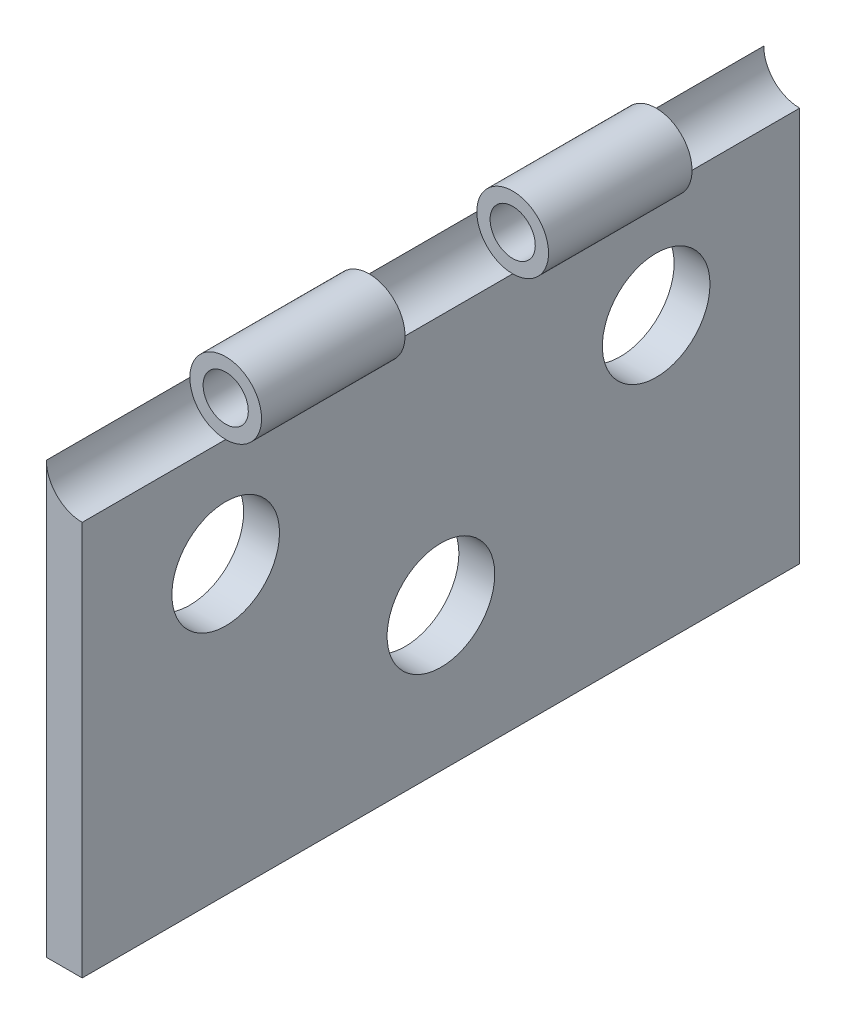
ISO-10303-21;
HEADER;
FILE_DESCRIPTION(('STEP AP214'),'2;1');
FILE_NAME('part.step','',(''),(''),'','','');
FILE_SCHEMA(('AUTOMOTIVE_DESIGN { 1 0 10303 214 1 1 1 1 }'));
ENDSEC;
DATA;
#1=APPLICATION_CONTEXT('core data for automotive mechanical design processes');
#2=APPLICATION_PROTOCOL_DEFINITION('international standard','automotive_design',2000,#1);
#3=PRODUCT_CONTEXT('',#1,'mechanical');
#4=PRODUCT('Part','Part','',(#3));
#5=PRODUCT_RELATED_PRODUCT_CATEGORY('part','',(#4));
#6=PRODUCT_DEFINITION_FORMATION('','',#4);
#7=PRODUCT_DEFINITION_CONTEXT('part definition',#1,'design');
#8=PRODUCT_DEFINITION('design','',#6,#7);
#9=PRODUCT_DEFINITION_SHAPE('','',#8);
#10=(LENGTH_UNIT() NAMED_UNIT(*) SI_UNIT(.MILLI.,.METRE.));
#11=(NAMED_UNIT(*) PLANE_ANGLE_UNIT() SI_UNIT($,.RADIAN.));
#12=(NAMED_UNIT(*) SI_UNIT($,.STERADIAN.) SOLID_ANGLE_UNIT());
#13=UNCERTAINTY_MEASURE_WITH_UNIT(LENGTH_MEASURE(1.E-05),#10,'distance_accuracy_value','');
#14=(GEOMETRIC_REPRESENTATION_CONTEXT(3) GLOBAL_UNCERTAINTY_ASSIGNED_CONTEXT((#13)) GLOBAL_UNIT_ASSIGNED_CONTEXT((#10,
#11,#12)) REPRESENTATION_CONTEXT('',''));
#15=CARTESIAN_POINT('',(0.,0.,0.));
#16=DIRECTION('',(0.,0.,1.));
#17=DIRECTION('',(1.,0.,0.));
#18=AXIS2_PLACEMENT_3D('',#15,#16,#17);
#19=CARTESIAN_POINT('',(1.24999999999997,15.,0.));
#20=DIRECTION('',(0.,0.,-1.));
#21=DIRECTION('',(0.,0.999999999999983,0.));
#22=AXIS2_PLACEMENT_3D('',#19,#20,#21);
#23=CYLINDRICAL_SURFACE('',#22,0.7875);
#24=CARTESIAN_POINT('',(1.24999999999997,15.,-5.));
#25=DIRECTION('',(0.,0.,-1.));
#26=DIRECTION('',(0.,0.999999999999983,0.));
#27=AXIS2_PLACEMENT_3D('',#24,#25,#26);
#28=CIRCLE('',#27,0.7875);
#29=CARTESIAN_POINT('',(1.24999999999997,15.7875,-5.));
#30=VERTEX_POINT('',#29);
#31=EDGE_CURVE('E11',#30,#30,#28,.T.);
#32=ORIENTED_EDGE('',*,*,#31,.F.);
#33=EDGE_LOOP('',(#32));
#34=FACE_BOUND('',#33,.T.);
#35=CARTESIAN_POINT('',(1.24999999999997,15.,-9.99999999999998));
#36=DIRECTION('',(0.,0.,-1.));
#37=DIRECTION('',(0.,0.999999999999983,0.));
#38=AXIS2_PLACEMENT_3D('',#35,#36,#37);
#39=CIRCLE('',#38,0.7875);
#40=CARTESIAN_POINT('',(1.24999999999997,15.7875,-9.99999999999998));
#41=VERTEX_POINT('',#40);
#42=EDGE_CURVE('E163',#41,#41,#39,.T.);
#43=ORIENTED_EDGE('',*,*,#42,.T.);
#44=EDGE_LOOP('',(#43));
#45=FACE_BOUND('',#44,.T.);
#46=ADVANCED_FACE('F32',(#34,#45),#23,.F.);
#47=CARTESIAN_POINT('',(1.24999999999997,15.,-15.));
#48=DIRECTION('',(0.,0.,-1.));
#49=DIRECTION('',(0.,0.999999999999983,0.));
#50=AXIS2_PLACEMENT_3D('',#47,#48,#49);
#51=CIRCLE('',#50,0.7875);
#52=CARTESIAN_POINT('',(1.24999999999997,15.7875,-15.));
#53=VERTEX_POINT('',#52);
#54=EDGE_CURVE('E160',#53,#53,#51,.T.);
#55=ORIENTED_EDGE('',*,*,#54,.F.);
#56=EDGE_LOOP('',(#55));
#57=FACE_BOUND('',#56,.T.);
#58=CARTESIAN_POINT('',(1.24999999999997,15.,-20.));
#59=DIRECTION('',(0.,0.,-1.));
#60=DIRECTION('',(0.,0.999999999999983,0.));
#61=AXIS2_PLACEMENT_3D('',#58,#59,#60);
#62=CIRCLE('',#61,0.7875);
#63=CARTESIAN_POINT('',(1.24999999999997,15.7875,-20.));
#64=VERTEX_POINT('',#63);
#65=EDGE_CURVE('E155',#64,#64,#62,.T.);
#66=ORIENTED_EDGE('',*,*,#65,.T.);
#67=EDGE_LOOP('',(#66));
#68=FACE_BOUND('',#67,.T.);
#69=ADVANCED_FACE('F244',(#57,#68),#23,.F.);
#70=CARTESIAN_POINT('',(1.24999999999997,0.,0.));
#71=DIRECTION('',(-1.,0.,0.));
#72=DIRECTION('',(0.,0.,1.));
#73=AXIS2_PLACEMENT_3D('',#70,#71,#72);
#74=PLANE('',#73);
#75=CARTESIAN_POINT('',(1.24999999999997,5.,-12.5));
#76=DIRECTION('',(1.,0.,0.));
#77=DIRECTION('',(0.,0.,-1.));
#78=AXIS2_PLACEMENT_3D('',#75,#76,#77);
#79=CIRCLE('',#78,1.875);
#80=CARTESIAN_POINT('',(1.24999999999997,5.,-14.375));
#81=VERTEX_POINT('',#80);
#82=EDGE_CURVE('E126',#81,#81,#79,.T.);
#83=ORIENTED_EDGE('',*,*,#82,.F.);
#84=EDGE_LOOP('',(#83));
#85=FACE_BOUND('',#84,.T.);
#86=DIRECTION('',(0.,0.,1.));
#87=VECTOR('',#86,1.);
#88=CARTESIAN_POINT('',(1.24999999999997,13.75,-9.99999999999998));
#89=LINE('',#88,#87);
#90=CARTESIAN_POINT('',(1.24999999999997,13.75,-5.));
#91=VERTEX_POINT('',#90);
#92=CARTESIAN_POINT('',(1.24999999999997,13.75,-9.99999999999998));
#93=VERTEX_POINT('',#92);
#94=EDGE_CURVE('E146',#91,#93,#89,.F.);
#95=ORIENTED_EDGE('',*,*,#94,.F.);
#96=DIRECTION('',(0.,0.,-1.));
#97=VECTOR('',#96,1.);
#98=CARTESIAN_POINT('',(1.24999999999997,13.75,0.));
#99=LINE('',#98,#97);
#100=CARTESIAN_POINT('',(1.24999999999997,13.75,0.));
#101=VERTEX_POINT('',#100);
#102=EDGE_CURVE('E97',#91,#101,#99,.F.);
#103=ORIENTED_EDGE('',*,*,#102,.T.);
#104=DIRECTION('',(0.,-0.999999999999983,0.));
#105=VECTOR('',#104,1.);
#106=CARTESIAN_POINT('',(1.24999999999997,0.,0.));
#107=LINE('',#106,#105);
#108=CARTESIAN_POINT('',(1.24999999999997,0.,0.));
#109=VERTEX_POINT('',#108);
#110=EDGE_CURVE('E96',#101,#109,#107,.T.);
#111=ORIENTED_EDGE('',*,*,#110,.T.);
#112=DIRECTION('',(0.,0.,-1.));
#113=VECTOR('',#112,1.);
#114=CARTESIAN_POINT('',(1.24999999999997,0.,0.));
#115=LINE('',#114,#113);
#116=CARTESIAN_POINT('',(1.24999999999997,0.,-25.));
#117=VERTEX_POINT('',#116);
#118=EDGE_CURVE('E56',#109,#117,#115,.T.);
#119=ORIENTED_EDGE('',*,*,#118,.T.);
#120=DIRECTION('',(0.,0.999999999999983,0.));
#121=VECTOR('',#120,1.);
#122=CARTESIAN_POINT('',(1.24999999999997,0.,-25.));
#123=LINE('',#122,#121);
#124=CARTESIAN_POINT('',(1.24999999999997,13.75,-25.));
#125=VERTEX_POINT('',#124);
#126=EDGE_CURVE('E111',#117,#125,#123,.T.);
#127=ORIENTED_EDGE('',*,*,#126,.T.);
#128=DIRECTION('',(0.,0.,-1.));
#129=VECTOR('',#128,1.);
#130=CARTESIAN_POINT('',(1.24999999999997,13.75,-20.));
#131=LINE('',#130,#129);
#132=CARTESIAN_POINT('',(1.24999999999997,13.75,-20.));
#133=VERTEX_POINT('',#132);
#134=EDGE_CURVE('E166',#125,#133,#131,.F.);
#135=ORIENTED_EDGE('',*,*,#134,.T.);
#136=DIRECTION('',(0.,0.,1.));
#137=VECTOR('',#136,1.);
#138=CARTESIAN_POINT('',(1.24999999999997,13.75,-20.));
#139=LINE('',#138,#137);
#140=CARTESIAN_POINT('',(1.24999999999997,13.75,-15.));
#141=VERTEX_POINT('',#140);
#142=EDGE_CURVE('E137',#141,#133,#139,.F.);
#143=ORIENTED_EDGE('',*,*,#142,.F.);
#144=DIRECTION('',(0.,0.,-1.));
#145=VECTOR('',#144,1.);
#146=CARTESIAN_POINT('',(1.24999999999997,13.75,-9.99999999999998));
#147=LINE('',#146,#145);
#148=EDGE_CURVE('E173',#141,#93,#147,.F.);
#149=ORIENTED_EDGE('',*,*,#148,.T.);
#150=EDGE_LOOP('',(#95,#103,#111,#119,#127,#135,#143,#149));
#151=FACE_BOUND('',#150,.T.);
#152=CARTESIAN_POINT('',(1.24999999999997,10.,-20.));
#153=DIRECTION('',(1.,0.,0.));
#154=DIRECTION('',(0.,0.,-1.));
#155=AXIS2_PLACEMENT_3D('',#152,#153,#154);
#156=CIRCLE('',#155,1.875);
#157=CARTESIAN_POINT('',(1.24999999999997,10.,-21.875));
#158=VERTEX_POINT('',#157);
#159=EDGE_CURVE('E104',#158,#158,#156,.T.);
#160=ORIENTED_EDGE('',*,*,#159,.F.);
#161=EDGE_LOOP('',(#160));
#162=FACE_BOUND('',#161,.T.);
#163=CARTESIAN_POINT('',(1.24999999999997,9.99999999999999,-5.));
#164=DIRECTION('',(1.,0.,0.));
#165=DIRECTION('',(0.,0.,-1.));
#166=AXIS2_PLACEMENT_3D('',#163,#164,#165);
#167=CIRCLE('',#166,1.875);
#168=CARTESIAN_POINT('',(1.24999999999997,9.99999999999999,-6.875));
#169=VERTEX_POINT('',#168);
#170=EDGE_CURVE('E131',#169,#169,#167,.T.);
#171=ORIENTED_EDGE('',*,*,#170,.F.);
#172=EDGE_LOOP('',(#171));
#173=FACE_BOUND('',#172,.T.);
#174=ADVANCED_FACE('F184',(#85,#151,#162,#173),#74,.F.);
#175=CARTESIAN_POINT('',(0.,0.,0.));
#176=DIRECTION('',(-1.,0.,0.));
#177=DIRECTION('',(0.,0.,1.));
#178=AXIS2_PLACEMENT_3D('',#175,#176,#177);
#179=PLANE('',#178);
#180=CARTESIAN_POINT('',(0.,5.,-12.5));
#181=DIRECTION('',(1.,0.,0.));
#182=DIRECTION('',(0.,0.,-1.));
#183=AXIS2_PLACEMENT_3D('',#180,#181,#182);
#184=CIRCLE('',#183,1.875);
#185=CARTESIAN_POINT('',(0.,5.,-14.375));
#186=VERTEX_POINT('',#185);
#187=EDGE_CURVE('E128',#186,#186,#184,.T.);
#188=ORIENTED_EDGE('',*,*,#187,.T.);
#189=EDGE_LOOP('',(#188));
#190=FACE_BOUND('',#189,.T.);
#191=DIRECTION('',(0.,-0.999999999999983,0.));
#192=VECTOR('',#191,1.);
#193=CARTESIAN_POINT('',(0.,0.,0.));
#194=LINE('',#193,#192);
#195=CARTESIAN_POINT('',(0.,15.,0.));
#196=VERTEX_POINT('',#195);
#197=CARTESIAN_POINT('',(0.,0.,0.));
#198=VERTEX_POINT('',#197);
#199=EDGE_CURVE('E95',#196,#198,#194,.T.);
#200=ORIENTED_EDGE('',*,*,#199,.F.);
#201=DIRECTION('',(0.,0.,1.));
#202=VECTOR('',#201,1.);
#203=CARTESIAN_POINT('',(0.,15.,0.));
#204=LINE('',#203,#202);
#205=CARTESIAN_POINT('',(0.,15.,-5.));
#206=VERTEX_POINT('',#205);
#207=EDGE_CURVE('E73',#206,#196,#204,.T.);
#208=ORIENTED_EDGE('',*,*,#207,.F.);
#209=CARTESIAN_POINT('',(0.,15.,-9.99999999999998));
#210=VERTEX_POINT('',#209);
#211=EDGE_CURVE('E87',#210,#206,#204,.T.);
#212=ORIENTED_EDGE('',*,*,#211,.F.);
#213=CARTESIAN_POINT('',(0.,15.,-15.));
#214=VERTEX_POINT('',#213);
#215=EDGE_CURVE('E198',#214,#210,#204,.T.);
#216=ORIENTED_EDGE('',*,*,#215,.F.);
#217=CARTESIAN_POINT('',(0.,15.,-20.));
#218=VERTEX_POINT('',#217);
#219=EDGE_CURVE('E117',#218,#214,#204,.T.);
#220=ORIENTED_EDGE('',*,*,#219,.F.);
#221=CARTESIAN_POINT('',(0.,15.,-25.));
#222=VERTEX_POINT('',#221);
#223=EDGE_CURVE('E90',#222,#218,#204,.T.);
#224=ORIENTED_EDGE('',*,*,#223,.F.);
#225=DIRECTION('',(0.,0.999999999999983,0.));
#226=VECTOR('',#225,1.);
#227=CARTESIAN_POINT('',(0.,0.,-25.));
#228=LINE('',#227,#226);
#229=CARTESIAN_POINT('',(0.,0.,-25.));
#230=VERTEX_POINT('',#229);
#231=EDGE_CURVE('E88',#230,#222,#228,.T.);
#232=ORIENTED_EDGE('',*,*,#231,.F.);
#233=DIRECTION('',(0.,0.,-1.));
#234=VECTOR('',#233,1.);
#235=CARTESIAN_POINT('',(0.,0.,0.));
#236=LINE('',#235,#234);
#237=EDGE_CURVE('E102',#198,#230,#236,.T.);
#238=ORIENTED_EDGE('',*,*,#237,.F.);
#239=EDGE_LOOP('',(#200,#208,#212,#216,#220,#224,#232,#238));
#240=FACE_BOUND('',#239,.T.);
#241=CARTESIAN_POINT('',(0.,10.,-20.));
#242=DIRECTION('',(1.,0.,0.));
#243=DIRECTION('',(0.,0.,-1.));
#244=AXIS2_PLACEMENT_3D('',#241,#242,#243);
#245=CIRCLE('',#244,1.875);
#246=CARTESIAN_POINT('',(0.,10.,-21.875));
#247=VERTEX_POINT('',#246);
#248=EDGE_CURVE('E108',#247,#247,#245,.T.);
#249=ORIENTED_EDGE('',*,*,#248,.T.);
#250=EDGE_LOOP('',(#249));
#251=FACE_BOUND('',#250,.T.);
#252=CARTESIAN_POINT('',(0.,9.99999999999999,-5.));
#253=DIRECTION('',(1.,0.,0.));
#254=DIRECTION('',(0.,0.,-1.));
#255=AXIS2_PLACEMENT_3D('',#252,#253,#254);
#256=CIRCLE('',#255,1.875);
#257=CARTESIAN_POINT('',(0.,9.99999999999999,-6.875));
#258=VERTEX_POINT('',#257);
#259=EDGE_CURVE('E134',#258,#258,#256,.T.);
#260=ORIENTED_EDGE('',*,*,#259,.T.);
#261=EDGE_LOOP('',(#260));
#262=FACE_BOUND('',#261,.T.);
#263=ADVANCED_FACE('F99',(#190,#240,#251,#262),#179,.T.);
#264=CARTESIAN_POINT('',(1.24999999999997,0.,0.));
#265=DIRECTION('',(0.,0.,-1.));
#266=DIRECTION('',(0.,0.999999999999983,0.));
#267=AXIS2_PLACEMENT_3D('',#264,#265,#266);
#268=PLANE('',#267);
#269=ORIENTED_EDGE('',*,*,#110,.F.);
#270=CARTESIAN_POINT('',(1.24999999999997,15.,0.));
#271=DIRECTION('',(0.,0.,-1.));
#272=DIRECTION('',(0.,0.999999999999983,0.));
#273=AXIS2_PLACEMENT_3D('',#270,#271,#272);
#274=CIRCLE('',#273,1.25);
#275=EDGE_CURVE('E78',#101,#196,#274,.T.);
#276=ORIENTED_EDGE('',*,*,#275,.T.);
#277=ORIENTED_EDGE('',*,*,#199,.T.);
#278=DIRECTION('',(-1.,0.,0.));
#279=VECTOR('',#278,1.);
#280=CARTESIAN_POINT('',(1.24999999999997,0.,0.));
#281=LINE('',#280,#279);
#282=EDGE_CURVE('E40',#109,#198,#281,.T.);
#283=ORIENTED_EDGE('',*,*,#282,.F.);
#284=EDGE_LOOP('',(#269,#276,#277,#283));
#285=FACE_BOUND('',#284,.T.);
#286=ADVANCED_FACE('F34',(#285),#268,.F.);
#287=CARTESIAN_POINT('',(1.24999999999997,0.,0.));
#288=DIRECTION('',(0.,0.999999999999983,0.));
#289=DIRECTION('',(0.,0.,1.));
#290=AXIS2_PLACEMENT_3D('',#287,#288,#289);
#291=PLANE('',#290);
#292=ORIENTED_EDGE('',*,*,#237,.T.);
#293=DIRECTION('',(-1.,0.,0.));
#294=VECTOR('',#293,1.);
#295=CARTESIAN_POINT('',(1.24999999999997,0.,-25.));
#296=LINE('',#295,#294);
#297=EDGE_CURVE('E118',#117,#230,#296,.T.);
#298=ORIENTED_EDGE('',*,*,#297,.F.);
#299=ORIENTED_EDGE('',*,*,#118,.F.);
#300=ORIENTED_EDGE('',*,*,#282,.T.);
#301=EDGE_LOOP('',(#292,#298,#299,#300));
#302=FACE_BOUND('',#301,.T.);
#303=ADVANCED_FACE('F121',(#302),#291,.F.);
#304=CARTESIAN_POINT('',(1.24999999999997,0.,-25.));
#305=DIRECTION('',(0.,0.,1.));
#306=DIRECTION('',(0.,-0.999999999999983,0.));
#307=AXIS2_PLACEMENT_3D('',#304,#305,#306);
#308=PLANE('',#307);
#309=ORIENTED_EDGE('',*,*,#231,.T.);
#310=CARTESIAN_POINT('',(1.24999999999997,15.,-25.));
#311=DIRECTION('',(0.,0.,-1.));
#312=DIRECTION('',(0.,0.999999999999983,0.));
#313=AXIS2_PLACEMENT_3D('',#310,#311,#312);
#314=CIRCLE('',#313,1.25);
#315=EDGE_CURVE('E170',#125,#222,#314,.T.);
#316=ORIENTED_EDGE('',*,*,#315,.F.);
#317=ORIENTED_EDGE('',*,*,#126,.F.);
#318=ORIENTED_EDGE('',*,*,#297,.T.);
#319=EDGE_LOOP('',(#309,#316,#317,#318));
#320=FACE_BOUND('',#319,.T.);
#321=ADVANCED_FACE('F333',(#320),#308,.F.);
#322=CARTESIAN_POINT('',(1.24999999999997,10.,-20.));
#323=DIRECTION('',(-1.,0.,0.));
#324=DIRECTION('',(0.,0.,1.));
#325=AXIS2_PLACEMENT_3D('',#322,#323,#324);
#326=CYLINDRICAL_SURFACE('',#325,1.875);
#327=ORIENTED_EDGE('',*,*,#159,.T.);
#328=EDGE_LOOP('',(#327));
#329=FACE_BOUND('',#328,.T.);
#330=ORIENTED_EDGE('',*,*,#248,.F.);
#331=EDGE_LOOP('',(#330));
#332=FACE_BOUND('',#331,.T.);
#333=ADVANCED_FACE('F325',(#329,#332),#326,.F.);
#334=CARTESIAN_POINT('',(1.24999999999997,5.,-12.5));
#335=DIRECTION('',(-1.,0.,0.));
#336=DIRECTION('',(0.,0.,1.));
#337=AXIS2_PLACEMENT_3D('',#334,#335,#336);
#338=CYLINDRICAL_SURFACE('',#337,1.875);
#339=ORIENTED_EDGE('',*,*,#82,.T.);
#340=EDGE_LOOP('',(#339));
#341=FACE_BOUND('',#340,.T.);
#342=ORIENTED_EDGE('',*,*,#187,.F.);
#343=EDGE_LOOP('',(#342));
#344=FACE_BOUND('',#343,.T.);
#345=ADVANCED_FACE('F317',(#341,#344),#338,.F.);
#346=CARTESIAN_POINT('',(1.24999999999997,9.99999999999999,-5.));
#347=DIRECTION('',(-1.,0.,0.));
#348=DIRECTION('',(0.,0.,1.));
#349=AXIS2_PLACEMENT_3D('',#346,#347,#348);
#350=CYLINDRICAL_SURFACE('',#349,1.875);
#351=ORIENTED_EDGE('',*,*,#170,.T.);
#352=EDGE_LOOP('',(#351));
#353=FACE_BOUND('',#352,.T.);
#354=ORIENTED_EDGE('',*,*,#259,.F.);
#355=EDGE_LOOP('',(#354));
#356=FACE_BOUND('',#355,.T.);
#357=ADVANCED_FACE('F310',(#353,#356),#350,.F.);
#358=CARTESIAN_POINT('',(1.24999999999997,15.,-20.));
#359=DIRECTION('',(0.,0.,1.));
#360=DIRECTION('',(0.,-0.999999999999983,0.));
#361=AXIS2_PLACEMENT_3D('',#358,#359,#360);
#362=CYLINDRICAL_SURFACE('',#361,1.25);
#363=CARTESIAN_POINT('',(1.24999999999997,15.,-15.));
#364=DIRECTION('',(0.,0.,-1.));
#365=DIRECTION('',(0.,0.999999999999983,0.));
#366=AXIS2_PLACEMENT_3D('',#363,#364,#365);
#367=CIRCLE('',#366,1.25);
#368=EDGE_CURVE('E143',#214,#141,#367,.T.);
#369=ORIENTED_EDGE('',*,*,#368,.T.);
#370=ORIENTED_EDGE('',*,*,#142,.T.);
#371=CARTESIAN_POINT('',(1.24999999999997,15.,-20.));
#372=DIRECTION('',(0.,0.,-1.));
#373=DIRECTION('',(0.,0.999999999999983,0.));
#374=AXIS2_PLACEMENT_3D('',#371,#372,#373);
#375=CIRCLE('',#374,1.25);
#376=EDGE_CURVE('E142',#218,#133,#375,.T.);
#377=ORIENTED_EDGE('',*,*,#376,.F.);
#378=ORIENTED_EDGE('',*,*,#219,.T.);
#379=EDGE_LOOP('',(#369,#370,#377,#378));
#380=FACE_BOUND('',#379,.T.);
#381=ADVANCED_FACE('F205',(#380),#362,.T.);
#382=CARTESIAN_POINT('',(1.24999999999997,15.,-20.));
#383=DIRECTION('',(0.,0.,-1.));
#384=DIRECTION('',(0.,0.999999999999983,0.));
#385=AXIS2_PLACEMENT_3D('',#382,#383,#384);
#386=PLANE('',#385);
#387=ORIENTED_EDGE('',*,*,#376,.T.);
#388=CARTESIAN_POINT('',(1.24999999999997,15.,-20.));
#389=DIRECTION('',(0.,0.,-1.));
#390=DIRECTION('',(0.,0.999999999999983,0.));
#391=AXIS2_PLACEMENT_3D('',#388,#389,#390);
#392=CIRCLE('',#391,1.25);
#393=EDGE_CURVE('E169',#133,#218,#392,.T.);
#394=ORIENTED_EDGE('',*,*,#393,.T.);
#395=EDGE_LOOP('',(#387,#394));
#396=FACE_BOUND('',#395,.T.);
#397=ORIENTED_EDGE('',*,*,#65,.F.);
#398=EDGE_LOOP('',(#397));
#399=FACE_BOUND('',#398,.T.);
#400=ADVANCED_FACE('F219',(#396,#399),#386,.T.);
#401=CARTESIAN_POINT('',(1.24999999999997,15.,-15.));
#402=DIRECTION('',(0.,0.,-1.));
#403=DIRECTION('',(0.,0.999999999999983,0.));
#404=AXIS2_PLACEMENT_3D('',#401,#402,#403);
#405=PLANE('',#404);
#406=ORIENTED_EDGE('',*,*,#54,.T.);
#407=EDGE_LOOP('',(#406));
#408=FACE_BOUND('',#407,.T.);
#409=ORIENTED_EDGE('',*,*,#368,.F.);
#410=CARTESIAN_POINT('',(1.24999999999997,15.,-15.));
#411=DIRECTION('',(0.,0.,-1.));
#412=DIRECTION('',(0.,0.999999999999983,0.));
#413=AXIS2_PLACEMENT_3D('',#410,#411,#412);
#414=CIRCLE('',#413,1.25);
#415=EDGE_CURVE('E47',#141,#214,#414,.T.);
#416=ORIENTED_EDGE('',*,*,#415,.F.);
#417=EDGE_LOOP('',(#409,#416));
#418=FACE_BOUND('',#417,.T.);
#419=ADVANCED_FACE('F209',(#408,#418),#405,.F.);
#420=CARTESIAN_POINT('',(1.24999999999997,15.,-9.99999999999998));
#421=DIRECTION('',(0.,0.,1.));
#422=DIRECTION('',(0.,-0.999999999999983,0.));
#423=AXIS2_PLACEMENT_3D('',#420,#421,#422);
#424=CYLINDRICAL_SURFACE('',#423,1.25);
#425=CARTESIAN_POINT('',(1.24999999999997,15.,-5.));
#426=DIRECTION('',(0.,0.,-1.));
#427=DIRECTION('',(0.,0.999999999999983,0.));
#428=AXIS2_PLACEMENT_3D('',#425,#426,#427);
#429=CIRCLE('',#428,1.25);
#430=EDGE_CURVE('E152',#206,#91,#429,.T.);
#431=ORIENTED_EDGE('',*,*,#430,.T.);
#432=ORIENTED_EDGE('',*,*,#94,.T.);
#433=CARTESIAN_POINT('',(1.24999999999997,15.,-9.99999999999998));
#434=DIRECTION('',(0.,0.,-1.));
#435=DIRECTION('',(0.,0.999999999999983,0.));
#436=AXIS2_PLACEMENT_3D('',#433,#434,#435);
#437=CIRCLE('',#436,1.25);
#438=EDGE_CURVE('E151',#210,#93,#437,.T.);
#439=ORIENTED_EDGE('',*,*,#438,.F.);
#440=ORIENTED_EDGE('',*,*,#211,.T.);
#441=EDGE_LOOP('',(#431,#432,#439,#440));
#442=FACE_BOUND('',#441,.T.);
#443=ADVANCED_FACE('F195',(#442),#424,.T.);
#444=CARTESIAN_POINT('',(1.24999999999997,15.,-9.99999999999998));
#445=DIRECTION('',(0.,0.,-1.));
#446=DIRECTION('',(0.,0.999999999999983,0.));
#447=AXIS2_PLACEMENT_3D('',#444,#445,#446);
#448=PLANE('',#447);
#449=ORIENTED_EDGE('',*,*,#42,.F.);
#450=EDGE_LOOP('',(#449));
#451=FACE_BOUND('',#450,.T.);
#452=CARTESIAN_POINT('',(1.24999999999997,15.,-9.99999999999998));
#453=DIRECTION('',(0.,0.,-1.));
#454=DIRECTION('',(0.,0.999999999999983,0.));
#455=AXIS2_PLACEMENT_3D('',#452,#453,#454);
#456=CIRCLE('',#455,1.25);
#457=EDGE_CURVE('E178',#93,#210,#456,.T.);
#458=ORIENTED_EDGE('',*,*,#457,.T.);
#459=ORIENTED_EDGE('',*,*,#438,.T.);
#460=EDGE_LOOP('',(#458,#459));
#461=FACE_BOUND('',#460,.T.);
#462=ADVANCED_FACE('F230',(#451,#461),#448,.T.);
#463=CARTESIAN_POINT('',(1.24999999999997,15.,-5.));
#464=DIRECTION('',(0.,0.,-1.));
#465=DIRECTION('',(0.,0.999999999999983,0.));
#466=AXIS2_PLACEMENT_3D('',#463,#464,#465);
#467=PLANE('',#466);
#468=ORIENTED_EDGE('',*,*,#31,.T.);
#469=EDGE_LOOP('',(#468));
#470=FACE_BOUND('',#469,.T.);
#471=ORIENTED_EDGE('',*,*,#430,.F.);
#472=CARTESIAN_POINT('',(1.24999999999997,15.,-5.));
#473=DIRECTION('',(0.,0.,-1.));
#474=DIRECTION('',(0.,0.999999999999983,0.));
#475=AXIS2_PLACEMENT_3D('',#472,#473,#474);
#476=CIRCLE('',#475,1.25);
#477=EDGE_CURVE('E82',#91,#206,#476,.T.);
#478=ORIENTED_EDGE('',*,*,#477,.F.);
#479=EDGE_LOOP('',(#471,#478));
#480=FACE_BOUND('',#479,.T.);
#481=ADVANCED_FACE('F191',(#470,#480),#467,.F.);
#482=CARTESIAN_POINT('',(1.24999999999997,15.,-20.));
#483=DIRECTION('',(0.,0.,-1.));
#484=DIRECTION('',(0.,0.999999999999983,0.));
#485=AXIS2_PLACEMENT_3D('',#482,#483,#484);
#486=CYLINDRICAL_SURFACE('',#485,1.25);
#487=ORIENTED_EDGE('',*,*,#315,.T.);
#488=ORIENTED_EDGE('',*,*,#223,.T.);
#489=ORIENTED_EDGE('',*,*,#393,.F.);
#490=ORIENTED_EDGE('',*,*,#134,.F.);
#491=EDGE_LOOP('',(#487,#488,#489,#490));
#492=FACE_BOUND('',#491,.T.);
#493=ADVANCED_FACE('F222',(#492),#486,.F.);
#494=CARTESIAN_POINT('',(1.24999999999997,15.,-9.99999999999998));
#495=DIRECTION('',(0.,0.,-1.));
#496=DIRECTION('',(0.,0.999999999999983,0.));
#497=AXIS2_PLACEMENT_3D('',#494,#495,#496);
#498=CYLINDRICAL_SURFACE('',#497,1.25);
#499=ORIENTED_EDGE('',*,*,#415,.T.);
#500=ORIENTED_EDGE('',*,*,#215,.T.);
#501=ORIENTED_EDGE('',*,*,#457,.F.);
#502=ORIENTED_EDGE('',*,*,#148,.F.);
#503=EDGE_LOOP('',(#499,#500,#501,#502));
#504=FACE_BOUND('',#503,.T.);
#505=ADVANCED_FACE('F228',(#504),#498,.F.);
#506=CARTESIAN_POINT('',(1.24999999999997,15.,0.));
#507=DIRECTION('',(0.,0.,-1.));
#508=DIRECTION('',(0.,0.999999999999983,0.));
#509=AXIS2_PLACEMENT_3D('',#506,#507,#508);
#510=CYLINDRICAL_SURFACE('',#509,1.25);
#511=ORIENTED_EDGE('',*,*,#477,.T.);
#512=ORIENTED_EDGE('',*,*,#207,.T.);
#513=ORIENTED_EDGE('',*,*,#275,.F.);
#514=ORIENTED_EDGE('',*,*,#102,.F.);
#515=EDGE_LOOP('',(#511,#512,#513,#514));
#516=FACE_BOUND('',#515,.T.);
#517=ADVANCED_FACE('F75',(#516),#510,.F.);
#518=CLOSED_SHELL('',(#46,#69,#174,#263,#286,#303,#321,#333,#345,#357,#381,#400,#419,#443,#462,
#481,#493,#505,#517));
#519=MANIFOLD_SOLID_BREP('B2',#518);
#520=ADVANCED_BREP_SHAPE_REPRESENTATION('',(#18,#519),#14);
#521=SHAPE_DEFINITION_REPRESENTATION(#9,#520);
ENDSEC;
END-ISO-10303-21;
